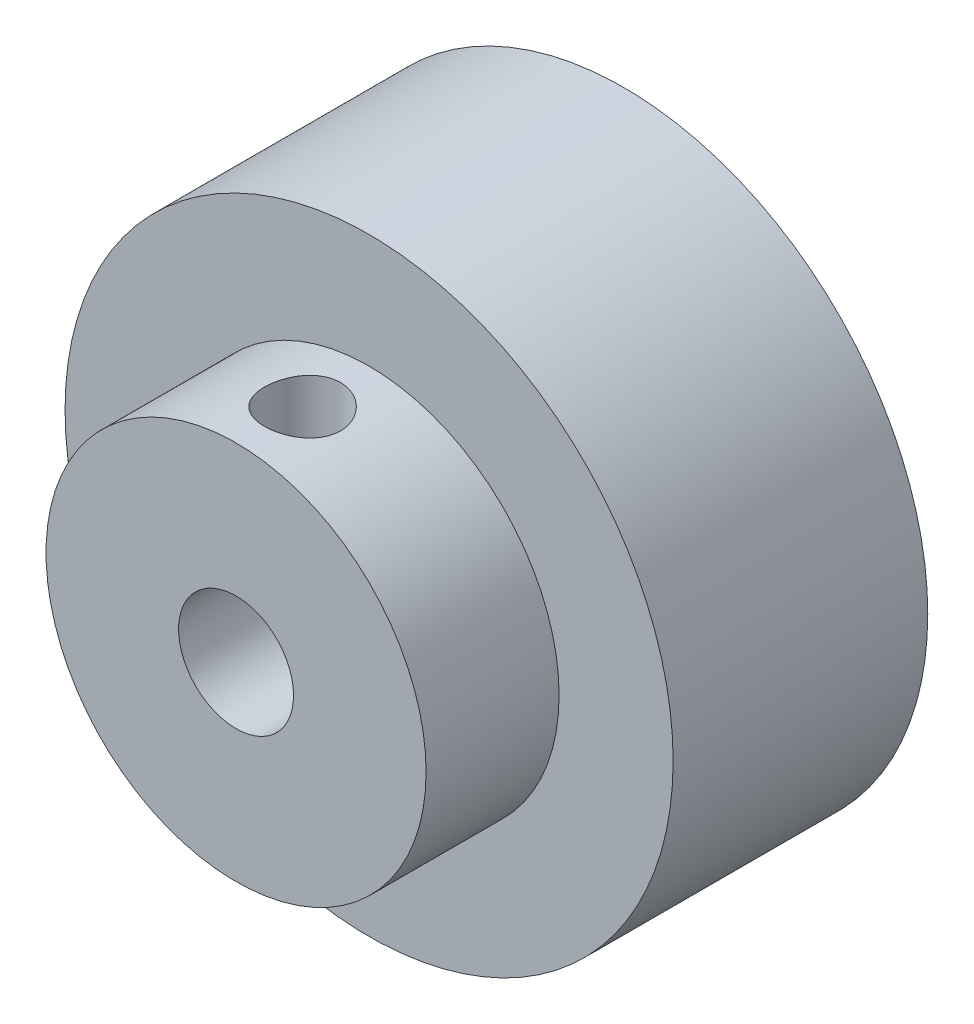
ISO-10303-21;
HEADER;
FILE_DESCRIPTION(('STEP AP214'),'2;1');
FILE_NAME('part.step','',(''),(''),'','','');
FILE_SCHEMA(('AUTOMOTIVE_DESIGN { 1 0 10303 214 1 1 1 1 }'));
ENDSEC;
DATA;
#1=APPLICATION_CONTEXT('core data for automotive mechanical design processes');
#2=APPLICATION_PROTOCOL_DEFINITION('international standard','automotive_design',2000,#1);
#3=PRODUCT_CONTEXT('',#1,'mechanical');
#4=PRODUCT('Part','Part','',(#3));
#5=PRODUCT_RELATED_PRODUCT_CATEGORY('part','',(#4));
#6=PRODUCT_DEFINITION_FORMATION('','',#4);
#7=PRODUCT_DEFINITION_CONTEXT('part definition',#1,'design');
#8=PRODUCT_DEFINITION('design','',#6,#7);
#9=PRODUCT_DEFINITION_SHAPE('','',#8);
#10=(LENGTH_UNIT() NAMED_UNIT(*) SI_UNIT(.MILLI.,.METRE.));
#11=(NAMED_UNIT(*) PLANE_ANGLE_UNIT() SI_UNIT($,.RADIAN.));
#12=(NAMED_UNIT(*) SI_UNIT($,.STERADIAN.) SOLID_ANGLE_UNIT());
#13=UNCERTAINTY_MEASURE_WITH_UNIT(LENGTH_MEASURE(1.E-05),#10,'distance_accuracy_value','');
#14=(GEOMETRIC_REPRESENTATION_CONTEXT(3) GLOBAL_UNCERTAINTY_ASSIGNED_CONTEXT((#13)) GLOBAL_UNIT_ASSIGNED_CONTEXT((#10,
#11,#12)) REPRESENTATION_CONTEXT('',''));
#15=CARTESIAN_POINT('',(0.,0.,0.));
#16=DIRECTION('',(0.,0.,1.));
#17=DIRECTION('',(1.,0.,0.));
#18=AXIS2_PLACEMENT_3D('',#15,#16,#17);
#19=CARTESIAN_POINT('',(0.,0.,13.7));
#20=DIRECTION('',(0.,0.,-1.));
#21=DIRECTION('',(-1.,0.,0.));
#22=AXIS2_PLACEMENT_3D('',#19,#20,#21);
#23=CYLINDRICAL_SURFACE('',#22,10.);
#24=CARTESIAN_POINT('',(0.,0.,13.7));
#25=DIRECTION('',(0.,0.,1.));
#26=DIRECTION('',(1.,0.,0.));
#27=AXIS2_PLACEMENT_3D('',#24,#25,#26);
#28=CIRCLE('',#27,10.);
#29=CARTESIAN_POINT('',(10.,0.,13.7));
#30=VERTEX_POINT('',#29);
#31=EDGE_CURVE('E70',#30,#30,#28,.T.);
#32=ORIENTED_EDGE('',*,*,#31,.F.);
#33=EDGE_LOOP('',(#32));
#34=FACE_BOUND('',#33,.T.);
#35=CARTESIAN_POINT('',(0.,0.,6.7));
#36=DIRECTION('',(0.,0.,1.));
#37=DIRECTION('',(1.,0.,0.));
#38=AXIS2_PLACEMENT_3D('',#35,#36,#37);
#39=CIRCLE('',#38,10.);
#40=CARTESIAN_POINT('',(10.,0.,6.7));
#41=VERTEX_POINT('',#40);
#42=EDGE_CURVE('E71',#41,#41,#39,.T.);
#43=ORIENTED_EDGE('',*,*,#42,.T.);
#44=EDGE_LOOP('',(#43));
#45=FACE_BOUND('',#44,.T.);
#46=CARTESIAN_POINT('',(0.,10.,8.2));
#47=CARTESIAN_POINT('',(-0.111153813585266,9.99999795161742,8.20000408899669));
#48=CARTESIAN_POINT('',(-0.222359320403044,9.99812770356462,8.20929768593529));
#49=CARTESIAN_POINT('',(-0.441627015378038,9.99084731246463,8.24619700023049));
#50=CARTESIAN_POINT('',(-0.549686635082711,9.98543435720372,8.27381726560302));
#51=CARTESIAN_POINT('',(-0.759460610526626,9.97167298556573,8.34648254724158));
#52=CARTESIAN_POINT('',(-0.861180935866267,9.96332738153436,8.39151087368938));
#53=CARTESIAN_POINT('',(-1.05561597772845,9.94460796070629,8.49766449502259));
#54=CARTESIAN_POINT('',(-1.14833123015162,9.93423426471414,8.55878883121441));
#55=CARTESIAN_POINT('',(-1.32338695462973,9.9124433065994,8.69627698858287));
#56=CARTESIAN_POINT('',(-1.40558790231705,9.90101491008695,8.7728167107824));
#57=CARTESIAN_POINT('',(-1.55607351321606,9.87848360905177,8.9385848327834));
#58=CARTESIAN_POINT('',(-1.62435708954085,9.86738073000848,9.02781422267024));
#59=CARTESIAN_POINT('',(-1.74566350669524,9.8466488362523,9.21743238602375));
#60=CARTESIAN_POINT('',(-1.79854187773173,9.83703414729892,9.31791528759272));
#61=CARTESIAN_POINT('',(-1.88661133316062,9.82052536116836,9.52656363800816));
#62=CARTESIAN_POINT('',(-1.92180416487448,9.81363099523923,9.63472832669269));
#63=CARTESIAN_POINT('',(-1.97305059976965,9.80345610504409,9.85416872781583));
#64=CARTESIAN_POINT('',(-1.98934899591755,9.80012940214375,9.96538508828445));
#65=CARTESIAN_POINT('',(-2.00310425545224,9.79732750121254,10.1890196427287));
#66=CARTESIAN_POINT('',(-2.000563045427,9.79785190935681,10.3014377126403));
#67=CARTESIAN_POINT('',(-1.97690914620364,9.80265102296369,10.522493576042));
#68=CARTESIAN_POINT('',(-1.95607708048781,9.80686905717527,10.6311628112546));
#69=CARTESIAN_POINT('',(-1.8968757692461,9.81849092320002,10.843432153326));
#70=CARTESIAN_POINT('',(-1.85850568620136,9.82589490715558,10.947032017838));
#71=CARTESIAN_POINT('',(-1.76504956734944,9.84311237000816,11.1470305234072));
#72=CARTESIAN_POINT('',(-1.70985230246423,9.85294179627409,11.2433757591383));
#73=CARTESIAN_POINT('',(-1.58438714914536,9.87389237546124,11.4255416999456));
#74=CARTESIAN_POINT('',(-1.51411752871366,9.88501367676732,11.5113611937023));
#75=CARTESIAN_POINT('',(-1.35899986912117,9.90754042482924,11.6716588049139));
#76=CARTESIAN_POINT('',(-1.27391232242489,9.9189473842181,11.7459051357183));
#77=CARTESIAN_POINT('',(-1.09237004812402,9.94057697428817,11.8791076926024));
#78=CARTESIAN_POINT('',(-0.99591517475878,9.95079958977947,11.9380637225872));
#79=CARTESIAN_POINT('',(-0.794118773757843,9.96893380321774,12.039055018452));
#80=CARTESIAN_POINT('',(-0.688763639170601,9.97684177696544,12.0810637872891));
#81=CARTESIAN_POINT('',(-0.472297952897331,9.98942817975716,12.1467209480771));
#82=CARTESIAN_POINT('',(-0.3611881001449,9.99410700001063,12.1703715641473));
#83=CARTESIAN_POINT('',(-0.138358811254302,9.99965343733735,12.1983129075886));
#84=CARTESIAN_POINT('',(-0.0266806566511532,10.0005834930494,12.2029208390805));
#85=CARTESIAN_POINT('',(0.195849868385427,9.99870103860205,12.1935002821156));
#86=CARTESIAN_POINT('',(0.306702284887586,9.99588873882892,12.1794728412948));
#87=CARTESIAN_POINT('',(0.523411319893081,9.98687664016035,12.1334432529121));
#88=CARTESIAN_POINT('',(0.629303896679805,9.98070752808413,12.1016038630042));
#89=CARTESIAN_POINT('',(0.834247254999334,9.96567104122065,12.0210320346884));
#90=CARTESIAN_POINT('',(0.933297523275078,9.95680346428454,11.9722983306463));
#91=CARTESIAN_POINT('',(1.12308234737243,9.93719823066589,11.8586350186974));
#92=CARTESIAN_POINT('',(1.21370025350438,9.92643900874104,11.7935144379221));
#93=CARTESIAN_POINT('',(1.38283603823841,9.90429469659765,11.6491816175854));
#94=CARTESIAN_POINT('',(1.46135261786152,9.89290953936776,11.5699678672003));
#95=CARTESIAN_POINT('',(1.60528118154835,9.8705860711393,11.3982532962178));
#96=CARTESIAN_POINT('',(1.67047540489731,9.85965720466609,11.3055685115573));
#97=CARTESIAN_POINT('',(1.78437084010241,9.83968383592389,11.1103772772866));
#98=CARTESIAN_POINT('',(1.8330727118458,9.83063925826685,11.0078712208529));
#99=CARTESIAN_POINT('',(1.91230368316392,9.81553481168766,10.7964635077009));
#100=CARTESIAN_POINT('',(1.9429269995821,9.80945949744373,10.6875983175794));
#101=CARTESIAN_POINT('',(1.98541730325439,9.8009487358405,10.4661330930182));
#102=CARTESIAN_POINT('',(1.99728673645022,9.79851281382223,10.3535335475813));
#103=CARTESIAN_POINT('',(2.00184182173494,9.79758299262758,10.1299822709114));
#104=CARTESIAN_POINT('',(1.99487157614179,9.79901838378602,10.019037702146));
#105=CARTESIAN_POINT('',(1.96270460820012,9.80551146969228,9.79993670018995));
#106=CARTESIAN_POINT('',(1.9375080322586,9.81056913534338,9.69178024461039));
#107=CARTESIAN_POINT('',(1.86975713699791,9.82370528438317,9.48154457751891));
#108=CARTESIAN_POINT('',(1.82724501343469,9.83177642037661,9.37945127899517));
#109=CARTESIAN_POINT('',(1.72610928920321,9.85003429948341,9.18379255853112));
#110=CARTESIAN_POINT('',(1.66748433754976,9.86022121997788,9.09022785254973));
#111=CARTESIAN_POINT('',(1.53461182957283,9.88177921046451,8.91256885569937));
#112=CARTESIAN_POINT('',(1.46011577447036,9.89316745819399,8.82866246946481));
#113=CARTESIAN_POINT('',(1.29812873802628,9.91572163743909,8.67442758894166));
#114=CARTESIAN_POINT('',(1.21063477430667,9.92688751726369,8.60410221936546));
#115=CARTESIAN_POINT('',(1.02403525817649,9.94787664775943,8.47833071210711));
#116=CARTESIAN_POINT('',(0.92481776885967,9.95768462438492,8.42304799343995));
#117=CARTESIAN_POINT('',(0.718332721881466,9.9747025017,8.33002775480682));
#118=CARTESIAN_POINT('',(0.611072521726253,9.98191474277232,8.29227442093502));
#119=CARTESIAN_POINT('',(0.419642977847559,9.99152745190741,8.24269610391057));
#120=CARTESIAN_POINT('',(0.336563328027569,9.99468606316904,8.22671361258449));
#121=CARTESIAN_POINT('',(0.168999050420133,9.99892308279786,8.20536417528327));
#122=CARTESIAN_POINT('',(0.0845144674972378,10.0000015574631,8.19999689098047));
#123=CARTESIAN_POINT('',(0.,10.,8.2));
#124=B_SPLINE_CURVE_WITH_KNOTS('',3,(#46,#47,#48,#49,#50,#51,#52,#53,#54,#55,#56,#57,#58,#59,
#60,#61,#62,#63,#64,#65,#66,#67,#68,#69,#70,#71,#72,#73,#74,#75,#76,#77,#78,#79,#80,#81,#82,#83,
#84,#85,#86,#87,#88,#89,#90,#91,#92,#93,#94,#95,#96,#97,#98,#99,#100,#101,#102,#103,#104,#105,
#106,#107,#108,#109,#110,#111,#112,#113,#114,#115,#116,#117,#118,#119,#120,#121,#122,#123),
.UNSPECIFIED.,.T.,.F.,(4,2,2,2,2,2,2,2,2,2,2,2,2,2,2,2,2,2,2,2,2,2,2,2,2,2,2,2,2,2,2,2,2,2,2,2,
2,2,4),(0.,0.333152261322516,0.666569301382645,0.999667470500682,1.33274580446173,
1.66986534022437,2.00701119349473,2.34722390011845,2.68740298730395,3.02312370207175,
3.3588100856245,3.68943454012557,4.02007478507459,4.35294980407185,4.68586309499341,
5.02476504982701,5.3636713507964,5.70310549708048,6.04249851396072,6.3762147135253,
6.70991215315735,7.04060907901447,7.37133078432045,7.70610132066717,8.0409077669186,
8.38081257158451,8.72070377446933,9.05880762065446,9.39686736660829,9.72879445135402,
10.0607188698522,10.3918392250622,10.7229873516373,11.0597615247829,11.3966130906586,
11.7369899335127,12.0770591103504,12.3303755057979,12.5836838274199),.UNSPECIFIED.);
#125=CARTESIAN_POINT('',(0.,10.,8.2));
#126=VERTEX_POINT('',#125);
#127=EDGE_CURVE('E80',#126,#126,#124,.T.);
#128=ORIENTED_EDGE('',*,*,#127,.F.);
#129=EDGE_LOOP('',(#128));
#130=FACE_BOUND('',#129,.T.);
#131=ADVANCED_FACE('F33',(#34,#45,#130),#23,.T.);
#132=CARTESIAN_POINT('',(0.,0.,13.7));
#133=DIRECTION('',(0.,0.,-1.));
#134=DIRECTION('',(-1.,0.,0.));
#135=AXIS2_PLACEMENT_3D('',#132,#133,#134);
#136=CYLINDRICAL_SURFACE('',#135,3.025);
#137=CARTESIAN_POINT('',(0.,0.,6.7));
#138=DIRECTION('',(0.,0.,1.));
#139=DIRECTION('',(1.,0.,0.));
#140=AXIS2_PLACEMENT_3D('',#137,#138,#139);
#141=CIRCLE('',#140,3.025);
#142=CARTESIAN_POINT('',(3.025,0.,6.7));
#143=VERTEX_POINT('',#142);
#144=EDGE_CURVE('E77',#143,#143,#141,.T.);
#145=ORIENTED_EDGE('',*,*,#144,.F.);
#146=EDGE_LOOP('',(#145));
#147=FACE_BOUND('',#146,.T.);
#148=CARTESIAN_POINT('',(0.,0.,13.7));
#149=DIRECTION('',(0.,0.,1.));
#150=DIRECTION('',(1.,0.,0.));
#151=AXIS2_PLACEMENT_3D('',#148,#149,#150);
#152=CIRCLE('',#151,3.025);
#153=CARTESIAN_POINT('',(3.025,0.,13.7));
#154=VERTEX_POINT('',#153);
#155=EDGE_CURVE('E74',#154,#154,#152,.T.);
#156=ORIENTED_EDGE('',*,*,#155,.T.);
#157=EDGE_LOOP('',(#156));
#158=FACE_BOUND('',#157,.T.);
#159=CARTESIAN_POINT('',(0.,3.025,8.2));
#160=CARTESIAN_POINT('',(-0.100642617545443,3.0249987783567,8.20000120399706));
#161=CARTESIAN_POINT('',(-0.201297476451969,3.01993299908086,8.20763918314828));
#162=CARTESIAN_POINT('',(-0.399407420799123,3.00017112360042,8.23772383693425));
#163=CARTESIAN_POINT('',(-0.496860581658117,2.98546934240776,8.26017925352084));
#164=CARTESIAN_POINT('',(-0.685406514791431,2.94788928584531,8.31853239841244));
#165=CARTESIAN_POINT('',(-0.77652679162158,2.9250494038349,8.35436704448431));
#166=CARTESIAN_POINT('',(-0.951102248223408,2.87303630646243,8.43796086625516));
#167=CARTESIAN_POINT('',(-1.03455640299659,2.84386224593824,8.48572163337046));
#168=CARTESIAN_POINT('',(-1.1993664317277,2.77860517215513,8.59619850933004));
#169=CARTESIAN_POINT('',(-1.27995339778043,2.74214718793265,8.65983549631194));
#170=CARTESIAN_POINT('',(-1.43004114549588,2.66695898812271,8.79806837761625));
#171=CARTESIAN_POINT('',(-1.49952590979975,2.62822559792703,8.87267981240007));
#172=CARTESIAN_POINT('',(-1.63642694811529,2.54559569213749,9.04416649867465));
#173=CARTESIAN_POINT('',(-1.70185902015384,2.50182778570157,9.14270030985283));
#174=CARTESIAN_POINT('',(-1.81513895163526,2.42089760145931,9.35185343247864));
#175=CARTESIAN_POINT('',(-1.86301722866889,2.38372395524591,9.4624514031127));
#176=CARTESIAN_POINT('',(-1.92790941909835,2.33131127968343,9.66080288815675));
#177=CARTESIAN_POINT('',(-1.94983031145749,2.3128404086022,9.74608882179241));
#178=CARTESIAN_POINT('',(-1.98230173644163,2.28507624082387,9.92019621834675));
#179=CARTESIAN_POINT('',(-1.99287137832762,2.27576752231628,10.0090114775415));
#180=CARTESIAN_POINT('',(-2.00197996643278,2.26776224993919,10.188102308303));
#181=CARTESIAN_POINT('',(-2.00047243567843,2.26910669275792,10.2783821857446));
#182=CARTESIAN_POINT('',(-1.98542700585713,2.28227832992203,10.4571854861868));
#183=CARTESIAN_POINT('',(-1.97187893783001,2.29411438504498,10.5457073598269));
#184=CARTESIAN_POINT('',(-1.93441748703559,2.32577203848501,10.7150249556095));
#185=CARTESIAN_POINT('',(-1.91095118389035,2.3452468580049,10.7959886169975));
#186=CARTESIAN_POINT('',(-1.85474587741065,2.38994328199187,10.9529093217787));
#187=CARTESIAN_POINT('',(-1.82200382976829,2.41516677264586,11.0288647113465));
#188=CARTESIAN_POINT('',(-1.74062365832931,2.47464586658619,11.189914970672));
#189=CARTESIAN_POINT('',(-1.69011177897742,2.50969726935146,11.2737667143711));
#190=CARTESIAN_POINT('',(-1.57789269135683,2.58173148940282,11.4327776291153));
#191=CARTESIAN_POINT('',(-1.51617174973991,2.61871663588472,11.5079259496748));
#192=CARTESIAN_POINT('',(-1.36825223388174,2.69944551804657,11.6634469856888));
#193=CARTESIAN_POINT('',(-1.27963305562048,2.74299173909087,11.7416455785507));
#194=CARTESIAN_POINT('',(-1.08829088468167,2.82436277312043,11.8821621524632));
#195=CARTESIAN_POINT('',(-0.985581704313,2.86219311394096,11.9444955172644));
#196=CARTESIAN_POINT('',(-0.789532778941588,2.92157423058359,12.0401294705185));
#197=CARTESIAN_POINT('',(-0.698331651394648,2.9448638502207,12.0767301836017));
#198=CARTESIAN_POINT('',(-0.509974561365827,2.98324682151488,12.1364045017915));
#199=CARTESIAN_POINT('',(-0.412823666926969,2.99834704378092,12.1594894474371));
#200=CARTESIAN_POINT('',(-0.214732767837394,3.01901724877256,12.1909754675224));
#201=CARTESIAN_POINT('',(-0.113778916602817,3.02454808313808,12.1993162265056));
#202=CARTESIAN_POINT('',(0.0882749032008229,3.02539816006898,12.2006024658699));
#203=CARTESIAN_POINT('',(0.1893748658806,3.02071780334157,12.1935485503683));
#204=CARTESIAN_POINT('',(0.381767939018034,3.00226630998737,12.1654713815535));
#205=CARTESIAN_POINT('',(0.473265865733124,2.9891210741874,12.1454093059232));
#206=CARTESIAN_POINT('',(0.651304981345677,2.95544286376606,12.0932545777779));
#207=CARTESIAN_POINT('',(0.737845372463182,2.93490870394887,12.0611599951939));
#208=CARTESIAN_POINT('',(0.90967129636838,2.88645021717455,11.9837986244011));
#209=CARTESIAN_POINT('',(0.994525548315691,2.85813838308447,11.9378228543548));
#210=CARTESIAN_POINT('',(1.15562685582589,2.79688987995517,11.8351349952313));
#211=CARTESIAN_POINT('',(1.23186824324879,2.76395019694144,11.7784159009105));
#212=CARTESIAN_POINT('',(1.38625078703641,2.69023227350938,11.6457657904491));
#213=CARTESIAN_POINT('',(1.46280246171431,2.64903627604967,11.5682160416802));
#214=CARTESIAN_POINT('',(1.60248518218092,2.56694988781008,11.4016111254721));
#215=CARTESIAN_POINT('',(1.66560818311131,2.52605969430336,11.3125491123265));
#216=CARTESIAN_POINT('',(1.77180282800471,2.45256947866062,11.1330116479057));
#217=CARTESIAN_POINT('',(1.816225542226,2.41955004513944,11.0435113156178));
#218=CARTESIAN_POINT('',(1.89174612763738,2.36097775731043,10.8568040613348));
#219=CARTESIAN_POINT('',(1.92286805386102,2.33541145056868,10.7596114318735));
#220=CARTESIAN_POINT('',(1.96611703059194,2.29905930446256,10.5763918780719));
#221=CARTESIAN_POINT('',(1.98057383955256,2.2864996133779,10.491275789339));
#222=CARTESIAN_POINT('',(1.99832459579881,2.27100707562215,10.3190500244278));
#223=CARTESIAN_POINT('',(2.00162949221253,2.26806478651924,10.2319423882528));
#224=CARTESIAN_POINT('',(1.99686400840466,2.27226006140056,10.0582863660211));
#225=CARTESIAN_POINT('',(1.98879215912862,2.27939892714264,9.97173805363841));
#226=CARTESIAN_POINT('',(1.96180765860033,2.30265967673578,9.80155537000174));
#227=CARTESIAN_POINT('',(1.94288066764141,2.31879344211434,9.7179250087073));
#228=CARTESIAN_POINT('',(1.88853640463144,2.36338668506866,9.53281773634975));
#229=CARTESIAN_POINT('',(1.85000940230073,2.39401916394776,9.43278671871945));
#230=CARTESIAN_POINT('',(1.75875296775858,2.4618364901973,9.24186280751888));
#231=CARTESIAN_POINT('',(1.70600376756291,2.49903043253554,9.15098287671915));
#232=CARTESIAN_POINT('',(1.58660143921209,2.57652397210842,8.97772806406637));
#233=CARTESIAN_POINT('',(1.51972274368281,2.61686628824138,8.89552830736306));
#234=CARTESIAN_POINT('',(1.37352970310745,2.69647449530486,8.7423909046251));
#235=CARTESIAN_POINT('',(1.29421174234045,2.73574006934784,8.67145654520685));
#236=CARTESIAN_POINT('',(1.11295786075,2.81477128758288,8.53390374857185));
#237=CARTESIAN_POINT('',(1.00942412682183,2.85394790411945,8.46902276178671));
#238=CARTESIAN_POINT('',(0.789646169800199,2.9223698098855,8.3583946535448));
#239=CARTESIAN_POINT('',(0.673425510575367,2.95163311005192,8.31261279654635));
#240=CARTESIAN_POINT('',(0.46395446902743,2.99057955194841,8.25235804291387));
#241=CARTESIAN_POINT('',(0.372726683285131,3.00339087807589,8.23281288538721));
#242=CARTESIAN_POINT('',(0.187668467681292,3.02059926936491,8.20663698970701));
#243=CARTESIAN_POINT('',(0.0938395550181361,3.02500113906481,8.19999887738861));
#244=CARTESIAN_POINT('',(0.,3.025,8.2));
#245=B_SPLINE_CURVE_WITH_KNOTS('',3,(#159,#160,#161,#162,#163,#164,#165,#166,#167,#168,#169,
#170,#171,#172,#173,#174,#175,#176,#177,#178,#179,#180,#181,#182,#183,#184,#185,#186,#187,#188,
#189,#190,#191,#192,#193,#194,#195,#196,#197,#198,#199,#200,#201,#202,#203,#204,#205,#206,#207,
#208,#209,#210,#211,#212,#213,#214,#215,#216,#217,#218,#219,#220,#221,#222,#223,#224,#225,#226,
#227,#228,#229,#230,#231,#232,#233,#234,#235,#236,#237,#238,#239,#240,#241,#242,#243,#244),
.UNSPECIFIED.,.T.,.F.,(4,2,2,2,2,2,2,2,2,2,2,2,2,2,2,2,2,2,2,2,2,2,2,2,2,2,2,2,2,2,2,2,2,2,2,2,
2,2,2,2,2,2,4),(0.,0.3015487261854,0.603275518532284,0.90359729337094,1.20395916445007,
1.5296221539219,1.85575082198353,2.23234945588228,2.60829239236122,2.87713902044293,
3.14553234581872,3.41495903262255,3.6846134829861,3.94322790551536,4.20192730406333,
4.51276392728465,4.8239839889588,5.20005220793539,5.57575437031097,5.87746307605225,
6.17891826595883,6.4816038183107,6.78427749289962,7.06680260771109,7.3493730602407,
7.64994767467169,7.95071895936768,8.29882678891969,8.64714257948896,8.96167116055969,
9.27562847127144,9.53621105204698,9.79653771407239,10.0568979945935,10.3176030073973,
10.6502710247593,10.983403835499,11.3223223758499,11.6613396128591,12.0440942372523,
12.4261496795824,12.7074756225657,12.9886407886918),.UNSPECIFIED.);
#246=CARTESIAN_POINT('',(0.,3.025,8.2));
#247=VERTEX_POINT('',#246);
#248=EDGE_CURVE('E37',#247,#247,#245,.T.);
#249=ORIENTED_EDGE('',*,*,#248,.T.);
#250=EDGE_LOOP('',(#249));
#251=FACE_BOUND('',#250,.T.);
#252=ADVANCED_FACE('F96',(#147,#158,#251),#136,.F.);
#253=CARTESIAN_POINT('',(0.,0.,6.7));
#254=DIRECTION('',(0.,0.,1.));
#255=DIRECTION('',(1.,0.,0.));
#256=AXIS2_PLACEMENT_3D('',#253,#254,#255);
#257=PLANE('',#256);
#258=ORIENTED_EDGE('',*,*,#42,.F.);
#259=EDGE_LOOP('',(#258));
#260=FACE_BOUND('',#259,.T.);
#261=CARTESIAN_POINT('',(0.,0.,6.7));
#262=DIRECTION('',(0.,0.,1.));
#263=DIRECTION('',(1.,0.,0.));
#264=AXIS2_PLACEMENT_3D('',#261,#262,#263);
#265=CIRCLE('',#264,16.);
#266=CARTESIAN_POINT('',(16.,0.,6.7));
#267=VERTEX_POINT('',#266);
#268=EDGE_CURVE('E10',#267,#267,#265,.T.);
#269=ORIENTED_EDGE('',*,*,#268,.T.);
#270=EDGE_LOOP('',(#269));
#271=FACE_BOUND('',#270,.T.);
#272=ADVANCED_FACE('F101',(#260,#271),#257,.T.);
#273=CARTESIAN_POINT('',(0.,0.,-6.7));
#274=DIRECTION('',(0.,0.,1.));
#275=DIRECTION('',(1.,0.,0.));
#276=AXIS2_PLACEMENT_3D('',#273,#274,#275);
#277=PLANE('',#276);
#278=CARTESIAN_POINT('',(0.,0.,-6.7));
#279=DIRECTION('',(0.,0.,1.));
#280=DIRECTION('',(1.,0.,0.));
#281=AXIS2_PLACEMENT_3D('',#278,#279,#280);
#282=CIRCLE('',#281,16.);
#283=CARTESIAN_POINT('',(16.,0.,-6.7));
#284=VERTEX_POINT('',#283);
#285=EDGE_CURVE('E46',#284,#284,#282,.T.);
#286=ORIENTED_EDGE('',*,*,#285,.F.);
#287=EDGE_LOOP('',(#286));
#288=FACE_BOUND('',#287,.T.);
#289=CARTESIAN_POINT('',(0.,0.,-6.7));
#290=DIRECTION('',(0.,0.,1.));
#291=DIRECTION('',(1.,0.,0.));
#292=AXIS2_PLACEMENT_3D('',#289,#290,#291);
#293=CIRCLE('',#292,3.1);
#294=CARTESIAN_POINT('',(3.1,0.,-6.7));
#295=VERTEX_POINT('',#294);
#296=EDGE_CURVE('E51',#295,#295,#293,.T.);
#297=ORIENTED_EDGE('',*,*,#296,.T.);
#298=EDGE_LOOP('',(#297));
#299=FACE_BOUND('',#298,.T.);
#300=ADVANCED_FACE('F127',(#288,#299),#277,.F.);
#301=CARTESIAN_POINT('',(0.,0.,6.7));
#302=DIRECTION('',(0.,0.,-1.));
#303=DIRECTION('',(-1.,0.,0.));
#304=AXIS2_PLACEMENT_3D('',#301,#302,#303);
#305=CYLINDRICAL_SURFACE('',#304,16.);
#306=ORIENTED_EDGE('',*,*,#268,.F.);
#307=EDGE_LOOP('',(#306));
#308=FACE_BOUND('',#307,.T.);
#309=ORIENTED_EDGE('',*,*,#285,.T.);
#310=EDGE_LOOP('',(#309));
#311=FACE_BOUND('',#310,.T.);
#312=ADVANCED_FACE('F35',(#308,#311),#305,.T.);
#313=CARTESIAN_POINT('',(0.,0.,6.7));
#314=DIRECTION('',(0.,0.,-1.));
#315=DIRECTION('',(-1.,0.,0.));
#316=AXIS2_PLACEMENT_3D('',#313,#314,#315);
#317=CYLINDRICAL_SURFACE('',#316,3.1);
#318=CARTESIAN_POINT('',(0.,0.,6.7));
#319=DIRECTION('',(0.,0.,1.));
#320=DIRECTION('',(1.,0.,0.));
#321=AXIS2_PLACEMENT_3D('',#318,#319,#320);
#322=CIRCLE('',#321,3.1);
#323=CARTESIAN_POINT('',(3.1,0.,6.7));
#324=VERTEX_POINT('',#323);
#325=EDGE_CURVE('E65',#324,#324,#322,.T.);
#326=ORIENTED_EDGE('',*,*,#325,.T.);
#327=EDGE_LOOP('',(#326));
#328=FACE_BOUND('',#327,.T.);
#329=ORIENTED_EDGE('',*,*,#296,.F.);
#330=EDGE_LOOP('',(#329));
#331=FACE_BOUND('',#330,.T.);
#332=ADVANCED_FACE('F107',(#328,#331),#317,.F.);
#333=CARTESIAN_POINT('',(0.,0.,6.7));
#334=DIRECTION('',(0.,0.,1.));
#335=DIRECTION('',(1.,0.,0.));
#336=AXIS2_PLACEMENT_3D('',#333,#334,#335);
#337=PLANE('',#336);
#338=ORIENTED_EDGE('',*,*,#144,.T.);
#339=EDGE_LOOP('',(#338));
#340=FACE_BOUND('',#339,.T.);
#341=ORIENTED_EDGE('',*,*,#325,.F.);
#342=EDGE_LOOP('',(#341));
#343=FACE_BOUND('',#342,.T.);
#344=ADVANCED_FACE('F104',(#340,#343),#337,.F.);
#345=CARTESIAN_POINT('',(0.,0.,13.7));
#346=DIRECTION('',(0.,0.,1.));
#347=DIRECTION('',(1.,0.,0.));
#348=AXIS2_PLACEMENT_3D('',#345,#346,#347);
#349=PLANE('',#348);
#350=ORIENTED_EDGE('',*,*,#31,.T.);
#351=EDGE_LOOP('',(#350));
#352=FACE_BOUND('',#351,.T.);
#353=ORIENTED_EDGE('',*,*,#155,.F.);
#354=EDGE_LOOP('',(#353));
#355=FACE_BOUND('',#354,.T.);
#356=ADVANCED_FACE('F94',(#352,#355),#349,.T.);
#357=CARTESIAN_POINT('',(0.,16.,10.2));
#358=DIRECTION('',(0.,-1.,0.));
#359=DIRECTION('',(0.,0.,-1.));
#360=AXIS2_PLACEMENT_3D('',#357,#358,#359);
#361=CYLINDRICAL_SURFACE('',#360,2.);
#362=ORIENTED_EDGE('',*,*,#248,.F.);
#363=EDGE_LOOP('',(#362));
#364=FACE_BOUND('',#363,.T.);
#365=ORIENTED_EDGE('',*,*,#127,.T.);
#366=EDGE_LOOP('',(#365));
#367=FACE_BOUND('',#366,.T.);
#368=ADVANCED_FACE('F91',(#364,#367),#361,.F.);
#369=CLOSED_SHELL('',(#131,#252,#272,#300,#312,#332,#344,#356,#368));
#370=CARTESIAN_POINT('',(0.,0.,-5.15));
#371=DIRECTION('',(0.,0.,1.));
#372=DIRECTION('',(1.,0.,0.));
#373=AXIS2_PLACEMENT_3D('',#370,#371,#372);
#374=CYLINDRICAL_SURFACE('',#373,13.6604075348495);
#375=CARTESIAN_POINT('',(0.,0.,-5.15));
#376=DIRECTION('',(0.,0.,1.));
#377=DIRECTION('',(1.,0.,0.));
#378=AXIS2_PLACEMENT_3D('',#375,#376,#377);
#379=CIRCLE('',#378,13.6604075348495);
#380=CARTESIAN_POINT('',(13.6604075348495,0.,-5.15));
#381=VERTEX_POINT('',#380);
#382=EDGE_CURVE('E55',#381,#381,#379,.T.);
#383=ORIENTED_EDGE('',*,*,#382,.F.);
#384=EDGE_LOOP('',(#383));
#385=FACE_BOUND('',#384,.T.);
#386=CARTESIAN_POINT('',(0.,0.,5.15));
#387=DIRECTION('',(0.,0.,1.));
#388=DIRECTION('',(1.,0.,0.));
#389=AXIS2_PLACEMENT_3D('',#386,#387,#388);
#390=CIRCLE('',#389,13.6604075348495);
#391=CARTESIAN_POINT('',(13.6604075348495,0.,5.15));
#392=VERTEX_POINT('',#391);
#393=EDGE_CURVE('E56',#392,#392,#390,.T.);
#394=ORIENTED_EDGE('',*,*,#393,.T.);
#395=EDGE_LOOP('',(#394));
#396=FACE_BOUND('',#395,.T.);
#397=ADVANCED_FACE('F134',(#385,#396),#374,.F.);
#398=CARTESIAN_POINT('',(0.,0.,-5.15));
#399=DIRECTION('',(0.,0.,1.));
#400=DIRECTION('',(1.,0.,0.));
#401=AXIS2_PLACEMENT_3D('',#398,#399,#400);
#402=PLANE('',#401);
#403=CARTESIAN_POINT('',(0.,0.,-5.15));
#404=DIRECTION('',(0.,0.,1.));
#405=DIRECTION('',(1.,0.,0.));
#406=AXIS2_PLACEMENT_3D('',#403,#404,#405);
#407=CIRCLE('',#406,7.85);
#408=CARTESIAN_POINT('',(7.85,0.,-5.15));
#409=VERTEX_POINT('',#408);
#410=EDGE_CURVE('E59',#409,#409,#407,.T.);
#411=ORIENTED_EDGE('',*,*,#410,.F.);
#412=EDGE_LOOP('',(#411));
#413=FACE_BOUND('',#412,.T.);
#414=ORIENTED_EDGE('',*,*,#382,.T.);
#415=EDGE_LOOP('',(#414));
#416=FACE_BOUND('',#415,.T.);
#417=ADVANCED_FACE('F137',(#413,#416),#402,.T.);
#418=CARTESIAN_POINT('',(0.,0.,5.15));
#419=DIRECTION('',(0.,0.,1.));
#420=DIRECTION('',(1.,0.,0.));
#421=AXIS2_PLACEMENT_3D('',#418,#419,#420);
#422=PLANE('',#421);
#423=CARTESIAN_POINT('',(0.,0.,5.15));
#424=DIRECTION('',(0.,0.,1.));
#425=DIRECTION('',(1.,0.,0.));
#426=AXIS2_PLACEMENT_3D('',#423,#424,#425);
#427=CIRCLE('',#426,7.85);
#428=CARTESIAN_POINT('',(7.85,0.,5.15));
#429=VERTEX_POINT('',#428);
#430=EDGE_CURVE('E62',#429,#429,#427,.T.);
#431=ORIENTED_EDGE('',*,*,#430,.T.);
#432=EDGE_LOOP('',(#431));
#433=FACE_BOUND('',#432,.T.);
#434=ORIENTED_EDGE('',*,*,#393,.F.);
#435=EDGE_LOOP('',(#434));
#436=FACE_BOUND('',#435,.T.);
#437=ADVANCED_FACE('F140',(#433,#436),#422,.F.);
#438=CARTESIAN_POINT('',(0.,0.,-5.15));
#439=DIRECTION('',(0.,0.,1.));
#440=DIRECTION('',(1.,0.,0.));
#441=AXIS2_PLACEMENT_3D('',#438,#439,#440);
#442=CYLINDRICAL_SURFACE('',#441,7.85);
#443=ORIENTED_EDGE('',*,*,#410,.T.);
#444=EDGE_LOOP('',(#443));
#445=FACE_BOUND('',#444,.T.);
#446=ORIENTED_EDGE('',*,*,#430,.F.);
#447=EDGE_LOOP('',(#446));
#448=FACE_BOUND('',#447,.T.);
#449=ADVANCED_FACE('F143',(#445,#448),#442,.T.);
#450=CLOSED_SHELL('',(#397,#417,#437,#449));
#451=ORIENTED_CLOSED_SHELL('',*,#450,.T.);
#452=BREP_WITH_VOIDS('B2',#369,(#451));
#453=ADVANCED_BREP_SHAPE_REPRESENTATION('',(#18,#452),#14);
#454=SHAPE_DEFINITION_REPRESENTATION(#9,#453);
ENDSEC;
END-ISO-10303-21;
